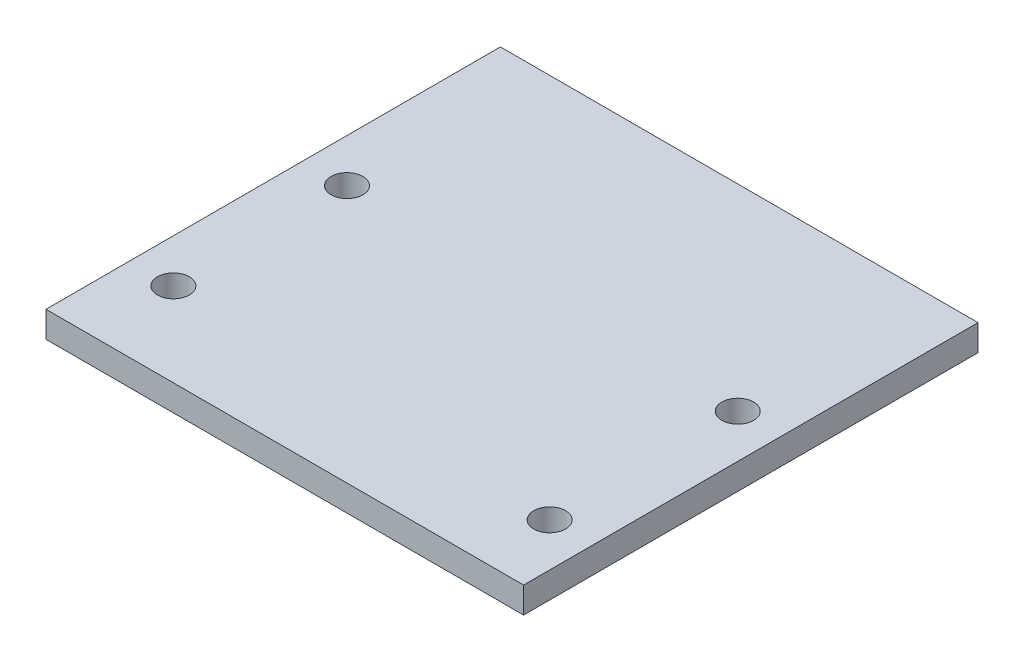
ISO-10303-21;
HEADER;
FILE_DESCRIPTION(('STEP AP214'),'2;1');
FILE_NAME('part.step','',(''),(''),'','','');
FILE_SCHEMA(('AUTOMOTIVE_DESIGN { 1 0 10303 214 1 1 1 1 }'));
ENDSEC;
DATA;
#1=APPLICATION_CONTEXT('core data for automotive mechanical design processes');
#2=APPLICATION_PROTOCOL_DEFINITION('international standard','automotive_design',2000,#1);
#3=PRODUCT_CONTEXT('',#1,'mechanical');
#4=PRODUCT('Part','Part','',(#3));
#5=PRODUCT_RELATED_PRODUCT_CATEGORY('part','',(#4));
#6=PRODUCT_DEFINITION_FORMATION('','',#4);
#7=PRODUCT_DEFINITION_CONTEXT('part definition',#1,'design');
#8=PRODUCT_DEFINITION('design','',#6,#7);
#9=PRODUCT_DEFINITION_SHAPE('','',#8);
#10=(LENGTH_UNIT() NAMED_UNIT(*) SI_UNIT(.MILLI.,.METRE.));
#11=(NAMED_UNIT(*) PLANE_ANGLE_UNIT() SI_UNIT($,.RADIAN.));
#12=(NAMED_UNIT(*) SI_UNIT($,.STERADIAN.) SOLID_ANGLE_UNIT());
#13=UNCERTAINTY_MEASURE_WITH_UNIT(LENGTH_MEASURE(1.E-05),#10,'distance_accuracy_value','');
#14=(GEOMETRIC_REPRESENTATION_CONTEXT(3) GLOBAL_UNCERTAINTY_ASSIGNED_CONTEXT((#13)) GLOBAL_UNIT_ASSIGNED_CONTEXT((#10,
#11,#12)) REPRESENTATION_CONTEXT('',''));
#15=CARTESIAN_POINT('',(0.,0.,0.));
#16=DIRECTION('',(0.,0.,1.));
#17=DIRECTION('',(1.,0.,0.));
#18=AXIS2_PLACEMENT_3D('',#15,#16,#17);
#19=CARTESIAN_POINT('',(0.,2.286,0.));
#20=DIRECTION('',(0.,1.,0.));
#21=DIRECTION('',(0.,0.,1.));
#22=AXIS2_PLACEMENT_3D('',#19,#20,#21);
#23=PLANE('',#22);
#24=CARTESIAN_POINT('',(-3.81,2.286,33.782));
#25=DIRECTION('',(0.,1.,0.));
#26=DIRECTION('',(0.,0.,-1.));
#27=AXIS2_PLACEMENT_3D('',#24,#25,#26);
#28=CIRCLE('',#27,1.39700000000001);
#29=CARTESIAN_POINT('',(-3.81,2.286,32.385));
#30=VERTEX_POINT('',#29);
#31=EDGE_CURVE('E120',#30,#30,#28,.T.);
#32=ORIENTED_EDGE('',*,*,#31,.F.);
#33=EDGE_LOOP('',(#32));
#34=FACE_BOUND('',#33,.T.);
#35=CARTESIAN_POINT('',(-38.1,2.286,17.272));
#36=DIRECTION('',(0.,1.,0.));
#37=DIRECTION('',(0.,0.,1.));
#38=AXIS2_PLACEMENT_3D('',#35,#36,#37);
#39=CIRCLE('',#38,1.39700000000001);
#40=CARTESIAN_POINT('',(-38.1,2.286,18.669));
#41=VERTEX_POINT('',#40);
#42=EDGE_CURVE('E99',#41,#41,#39,.T.);
#43=ORIENTED_EDGE('',*,*,#42,.F.);
#44=EDGE_LOOP('',(#43));
#45=FACE_BOUND('',#44,.T.);
#46=DIRECTION('',(0.,0.,-1.));
#47=VECTOR('',#46,1.);
#48=CARTESIAN_POINT('',(0.,2.286,39.878));
#49=LINE('',#48,#47);
#50=CARTESIAN_POINT('',(0.,2.286,39.878));
#51=VERTEX_POINT('',#50);
#52=CARTESIAN_POINT('',(0.,2.286,0.));
#53=VERTEX_POINT('',#52);
#54=EDGE_CURVE('E84',#51,#53,#49,.T.);
#55=ORIENTED_EDGE('',*,*,#54,.T.);
#56=DIRECTION('',(-1.,0.,0.));
#57=VECTOR('',#56,1.);
#58=CARTESIAN_POINT('',(0.,2.286,0.));
#59=LINE('',#58,#57);
#60=CARTESIAN_POINT('',(-41.91,2.286,0.));
#61=VERTEX_POINT('',#60);
#62=EDGE_CURVE('E79',#53,#61,#59,.T.);
#63=ORIENTED_EDGE('',*,*,#62,.T.);
#64=DIRECTION('',(0.,0.,1.));
#65=VECTOR('',#64,1.);
#66=CARTESIAN_POINT('',(-41.91,2.286,0.));
#67=LINE('',#66,#65);
#68=CARTESIAN_POINT('',(-41.91,2.286,39.878));
#69=VERTEX_POINT('',#68);
#70=EDGE_CURVE('E82',#61,#69,#67,.T.);
#71=ORIENTED_EDGE('',*,*,#70,.T.);
#72=DIRECTION('',(1.,0.,0.));
#73=VECTOR('',#72,1.);
#74=CARTESIAN_POINT('',(-41.91,2.286,39.878));
#75=LINE('',#74,#73);
#76=EDGE_CURVE('E49',#69,#51,#75,.T.);
#77=ORIENTED_EDGE('',*,*,#76,.T.);
#78=EDGE_LOOP('',(#55,#63,#71,#77));
#79=FACE_BOUND('',#78,.T.);
#80=CARTESIAN_POINT('',(-38.1,2.286,32.512));
#81=DIRECTION('',(0.,1.,0.));
#82=DIRECTION('',(0.,0.,1.));
#83=AXIS2_PLACEMENT_3D('',#80,#81,#82);
#84=CIRCLE('',#83,1.39700000000001);
#85=CARTESIAN_POINT('',(-38.1,2.286,33.909));
#86=VERTEX_POINT('',#85);
#87=EDGE_CURVE('E114',#86,#86,#84,.T.);
#88=ORIENTED_EDGE('',*,*,#87,.F.);
#89=EDGE_LOOP('',(#88));
#90=FACE_BOUND('',#89,.T.);
#91=CARTESIAN_POINT('',(-3.81,2.286,17.272));
#92=DIRECTION('',(0.,1.,0.));
#93=DIRECTION('',(0.,0.,-1.));
#94=AXIS2_PLACEMENT_3D('',#91,#92,#93);
#95=CIRCLE('',#94,1.39700000000001);
#96=CARTESIAN_POINT('',(-3.81,2.286,15.875));
#97=VERTEX_POINT('',#96);
#98=EDGE_CURVE('E126',#97,#97,#95,.T.);
#99=ORIENTED_EDGE('',*,*,#98,.F.);
#100=EDGE_LOOP('',(#99));
#101=FACE_BOUND('',#100,.T.);
#102=ADVANCED_FACE('F32',(#34,#45,#79,#90,#101),#23,.T.);
#103=CARTESIAN_POINT('',(0.,0.,0.));
#104=DIRECTION('',(0.,1.,0.));
#105=DIRECTION('',(0.,0.,1.));
#106=AXIS2_PLACEMENT_3D('',#103,#104,#105);
#107=PLANE('',#106);
#108=CARTESIAN_POINT('',(-3.81,0.,33.782));
#109=DIRECTION('',(0.,1.,0.));
#110=DIRECTION('',(0.,0.,-1.));
#111=AXIS2_PLACEMENT_3D('',#108,#109,#110);
#112=CIRCLE('',#111,1.39700000000001);
#113=CARTESIAN_POINT('',(-3.81,0.,32.385));
#114=VERTEX_POINT('',#113);
#115=EDGE_CURVE('E123',#114,#114,#112,.T.);
#116=ORIENTED_EDGE('',*,*,#115,.T.);
#117=EDGE_LOOP('',(#116));
#118=FACE_BOUND('',#117,.T.);
#119=CARTESIAN_POINT('',(-38.1,0.,17.272));
#120=DIRECTION('',(0.,1.,0.));
#121=DIRECTION('',(0.,0.,1.));
#122=AXIS2_PLACEMENT_3D('',#119,#120,#121);
#123=CIRCLE('',#122,1.39700000000001);
#124=CARTESIAN_POINT('',(-38.1,0.,18.669));
#125=VERTEX_POINT('',#124);
#126=EDGE_CURVE('E111',#125,#125,#123,.T.);
#127=ORIENTED_EDGE('',*,*,#126,.T.);
#128=EDGE_LOOP('',(#127));
#129=FACE_BOUND('',#128,.T.);
#130=DIRECTION('',(0.,0.,-1.));
#131=VECTOR('',#130,1.);
#132=CARTESIAN_POINT('',(0.,0.,39.878));
#133=LINE('',#132,#131);
#134=CARTESIAN_POINT('',(0.,0.,39.878));
#135=VERTEX_POINT('',#134);
#136=CARTESIAN_POINT('',(0.,0.,0.));
#137=VERTEX_POINT('',#136);
#138=EDGE_CURVE('E96',#135,#137,#133,.T.);
#139=ORIENTED_EDGE('',*,*,#138,.F.);
#140=DIRECTION('',(1.,0.,0.));
#141=VECTOR('',#140,1.);
#142=CARTESIAN_POINT('',(-41.91,0.,39.878));
#143=LINE('',#142,#141);
#144=CARTESIAN_POINT('',(-41.91,0.,39.878));
#145=VERTEX_POINT('',#144);
#146=EDGE_CURVE('E72',#145,#135,#143,.T.);
#147=ORIENTED_EDGE('',*,*,#146,.F.);
#148=DIRECTION('',(0.,0.,1.));
#149=VECTOR('',#148,1.);
#150=CARTESIAN_POINT('',(-41.91,0.,0.));
#151=LINE('',#150,#149);
#152=CARTESIAN_POINT('',(-41.91,0.,0.));
#153=VERTEX_POINT('',#152);
#154=EDGE_CURVE('E66',#153,#145,#151,.T.);
#155=ORIENTED_EDGE('',*,*,#154,.F.);
#156=DIRECTION('',(-1.,0.,0.));
#157=VECTOR('',#156,1.);
#158=CARTESIAN_POINT('',(0.,0.,0.));
#159=LINE('',#158,#157);
#160=EDGE_CURVE('E88',#137,#153,#159,.T.);
#161=ORIENTED_EDGE('',*,*,#160,.F.);
#162=EDGE_LOOP('',(#139,#147,#155,#161));
#163=FACE_BOUND('',#162,.T.);
#164=CARTESIAN_POINT('',(-38.1,0.,32.512));
#165=DIRECTION('',(0.,1.,0.));
#166=DIRECTION('',(0.,0.,1.));
#167=AXIS2_PLACEMENT_3D('',#164,#165,#166);
#168=CIRCLE('',#167,1.39700000000001);
#169=CARTESIAN_POINT('',(-38.1,0.,33.909));
#170=VERTEX_POINT('',#169);
#171=EDGE_CURVE('E117',#170,#170,#168,.T.);
#172=ORIENTED_EDGE('',*,*,#171,.T.);
#173=EDGE_LOOP('',(#172));
#174=FACE_BOUND('',#173,.T.);
#175=CARTESIAN_POINT('',(-3.81,0.,17.272));
#176=DIRECTION('',(0.,1.,0.));
#177=DIRECTION('',(0.,0.,-1.));
#178=AXIS2_PLACEMENT_3D('',#175,#176,#177);
#179=CIRCLE('',#178,1.39700000000001);
#180=CARTESIAN_POINT('',(-3.81,0.,15.875));
#181=VERTEX_POINT('',#180);
#182=EDGE_CURVE('E129',#181,#181,#179,.T.);
#183=ORIENTED_EDGE('',*,*,#182,.T.);
#184=EDGE_LOOP('',(#183));
#185=FACE_BOUND('',#184,.T.);
#186=ADVANCED_FACE('F107',(#118,#129,#163,#174,#185),#107,.F.);
#187=CARTESIAN_POINT('',(0.,2.286,39.878));
#188=DIRECTION('',(-1.,0.,0.));
#189=DIRECTION('',(0.,0.,1.));
#190=AXIS2_PLACEMENT_3D('',#187,#188,#189);
#191=PLANE('',#190);
#192=ORIENTED_EDGE('',*,*,#138,.T.);
#193=DIRECTION('',(0.,-1.,0.));
#194=VECTOR('',#193,1.);
#195=CARTESIAN_POINT('',(0.,2.286,0.));
#196=LINE('',#195,#194);
#197=EDGE_CURVE('E11',#53,#137,#196,.T.);
#198=ORIENTED_EDGE('',*,*,#197,.F.);
#199=ORIENTED_EDGE('',*,*,#54,.F.);
#200=DIRECTION('',(0.,-1.,0.));
#201=VECTOR('',#200,1.);
#202=CARTESIAN_POINT('',(0.,2.286,39.878));
#203=LINE('',#202,#201);
#204=EDGE_CURVE('E92',#51,#135,#203,.T.);
#205=ORIENTED_EDGE('',*,*,#204,.T.);
#206=EDGE_LOOP('',(#192,#198,#199,#205));
#207=FACE_BOUND('',#206,.T.);
#208=ADVANCED_FACE('F34',(#207),#191,.F.);
#209=CARTESIAN_POINT('',(0.,2.286,0.));
#210=DIRECTION('',(0.,0.,1.));
#211=DIRECTION('',(1.,0.,0.));
#212=AXIS2_PLACEMENT_3D('',#209,#210,#211);
#213=PLANE('',#212);
#214=ORIENTED_EDGE('',*,*,#160,.T.);
#215=DIRECTION('',(0.,-1.,0.));
#216=VECTOR('',#215,1.);
#217=CARTESIAN_POINT('',(-41.91,2.286,0.));
#218=LINE('',#217,#216);
#219=EDGE_CURVE('E41',#61,#153,#218,.T.);
#220=ORIENTED_EDGE('',*,*,#219,.F.);
#221=ORIENTED_EDGE('',*,*,#62,.F.);
#222=ORIENTED_EDGE('',*,*,#197,.T.);
#223=EDGE_LOOP('',(#214,#220,#221,#222));
#224=FACE_BOUND('',#223,.T.);
#225=ADVANCED_FACE('F87',(#224),#213,.F.);
#226=CARTESIAN_POINT('',(-41.91,2.286,0.));
#227=DIRECTION('',(1.,0.,0.));
#228=DIRECTION('',(0.,0.,-1.));
#229=AXIS2_PLACEMENT_3D('',#226,#227,#228);
#230=PLANE('',#229);
#231=ORIENTED_EDGE('',*,*,#154,.T.);
#232=DIRECTION('',(0.,-1.,0.));
#233=VECTOR('',#232,1.);
#234=CARTESIAN_POINT('',(-41.91,2.286,39.878));
#235=LINE('',#234,#233);
#236=EDGE_CURVE('E89',#69,#145,#235,.T.);
#237=ORIENTED_EDGE('',*,*,#236,.F.);
#238=ORIENTED_EDGE('',*,*,#70,.F.);
#239=ORIENTED_EDGE('',*,*,#219,.T.);
#240=EDGE_LOOP('',(#231,#237,#238,#239));
#241=FACE_BOUND('',#240,.T.);
#242=ADVANCED_FACE('F90',(#241),#230,.F.);
#243=CARTESIAN_POINT('',(-41.91,2.286,39.878));
#244=DIRECTION('',(0.,0.,-1.));
#245=DIRECTION('',(-1.,0.,0.));
#246=AXIS2_PLACEMENT_3D('',#243,#244,#245);
#247=PLANE('',#246);
#248=ORIENTED_EDGE('',*,*,#146,.T.);
#249=ORIENTED_EDGE('',*,*,#204,.F.);
#250=ORIENTED_EDGE('',*,*,#76,.F.);
#251=ORIENTED_EDGE('',*,*,#236,.T.);
#252=EDGE_LOOP('',(#248,#249,#250,#251));
#253=FACE_BOUND('',#252,.T.);
#254=ADVANCED_FACE('F104',(#253),#247,.F.);
#255=CARTESIAN_POINT('',(-38.1,2.286,17.272));
#256=DIRECTION('',(0.,-1.,0.));
#257=DIRECTION('',(0.,0.,-1.));
#258=AXIS2_PLACEMENT_3D('',#255,#256,#257);
#259=CYLINDRICAL_SURFACE('',#258,1.39700000000001);
#260=ORIENTED_EDGE('',*,*,#42,.T.);
#261=EDGE_LOOP('',(#260));
#262=FACE_BOUND('',#261,.T.);
#263=ORIENTED_EDGE('',*,*,#126,.F.);
#264=EDGE_LOOP('',(#263));
#265=FACE_BOUND('',#264,.T.);
#266=ADVANCED_FACE('F149',(#262,#265),#259,.F.);
#267=CARTESIAN_POINT('',(-38.1,2.286,32.512));
#268=DIRECTION('',(0.,-1.,0.));
#269=DIRECTION('',(0.,0.,-1.));
#270=AXIS2_PLACEMENT_3D('',#267,#268,#269);
#271=CYLINDRICAL_SURFACE('',#270,1.39700000000001);
#272=ORIENTED_EDGE('',*,*,#87,.T.);
#273=EDGE_LOOP('',(#272));
#274=FACE_BOUND('',#273,.T.);
#275=ORIENTED_EDGE('',*,*,#171,.F.);
#276=EDGE_LOOP('',(#275));
#277=FACE_BOUND('',#276,.T.);
#278=ADVANCED_FACE('F195',(#274,#277),#271,.F.);
#279=CARTESIAN_POINT('',(-3.81,2.286,33.782));
#280=DIRECTION('',(0.,-1.,0.));
#281=DIRECTION('',(0.,0.,-1.));
#282=AXIS2_PLACEMENT_3D('',#279,#280,#281);
#283=CYLINDRICAL_SURFACE('',#282,1.39700000000001);
#284=ORIENTED_EDGE('',*,*,#31,.T.);
#285=EDGE_LOOP('',(#284));
#286=FACE_BOUND('',#285,.T.);
#287=ORIENTED_EDGE('',*,*,#115,.F.);
#288=EDGE_LOOP('',(#287));
#289=FACE_BOUND('',#288,.T.);
#290=ADVANCED_FACE('F203',(#286,#289),#283,.F.);
#291=CARTESIAN_POINT('',(-3.81,2.286,17.272));
#292=DIRECTION('',(0.,-1.,0.));
#293=DIRECTION('',(0.,0.,-1.));
#294=AXIS2_PLACEMENT_3D('',#291,#292,#293);
#295=CYLINDRICAL_SURFACE('',#294,1.39700000000001);
#296=ORIENTED_EDGE('',*,*,#98,.T.);
#297=EDGE_LOOP('',(#296));
#298=FACE_BOUND('',#297,.T.);
#299=ORIENTED_EDGE('',*,*,#182,.F.);
#300=EDGE_LOOP('',(#299));
#301=FACE_BOUND('',#300,.T.);
#302=ADVANCED_FACE('F135',(#298,#301),#295,.F.);
#303=CLOSED_SHELL('',(#102,#186,#208,#225,#242,#254,#266,#278,#290,#302));
#304=MANIFOLD_SOLID_BREP('B2',#303);
#305=ADVANCED_BREP_SHAPE_REPRESENTATION('',(#18,#304),#14);
#306=SHAPE_DEFINITION_REPRESENTATION(#9,#305);
ENDSEC;
END-ISO-10303-21;
